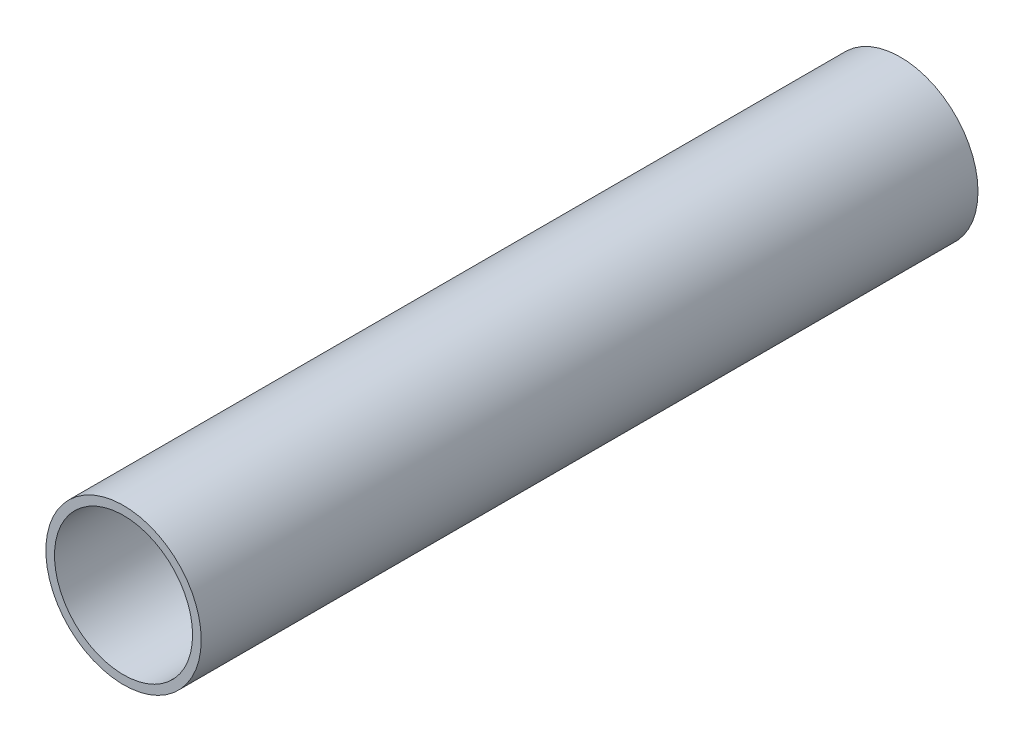
ISO-10303-21;
HEADER;
FILE_DESCRIPTION(('STEP AP214'),'2;1');
FILE_NAME('part.step','',(''),(''),'','','');
FILE_SCHEMA(('AUTOMOTIVE_DESIGN { 1 0 10303 214 1 1 1 1 }'));
ENDSEC;
DATA;
#1=APPLICATION_CONTEXT('core data for automotive mechanical design processes');
#2=APPLICATION_PROTOCOL_DEFINITION('international standard','automotive_design',2000,#1);
#3=PRODUCT_CONTEXT('',#1,'mechanical');
#4=PRODUCT('Part','Part','',(#3));
#5=PRODUCT_RELATED_PRODUCT_CATEGORY('part','',(#4));
#6=PRODUCT_DEFINITION_FORMATION('','',#4);
#7=PRODUCT_DEFINITION_CONTEXT('part definition',#1,'design');
#8=PRODUCT_DEFINITION('design','',#6,#7);
#9=PRODUCT_DEFINITION_SHAPE('','',#8);
#10=(LENGTH_UNIT() NAMED_UNIT(*) SI_UNIT(.MILLI.,.METRE.));
#11=(NAMED_UNIT(*) PLANE_ANGLE_UNIT() SI_UNIT($,.RADIAN.));
#12=(NAMED_UNIT(*) SI_UNIT($,.STERADIAN.) SOLID_ANGLE_UNIT());
#13=UNCERTAINTY_MEASURE_WITH_UNIT(LENGTH_MEASURE(1.E-05),#10,'distance_accuracy_value','');
#14=(GEOMETRIC_REPRESENTATION_CONTEXT(3) GLOBAL_UNCERTAINTY_ASSIGNED_CONTEXT((#13)) GLOBAL_UNIT_ASSIGNED_CONTEXT((#10,
#11,#12)) REPRESENTATION_CONTEXT('',''));
#15=CARTESIAN_POINT('',(0.,0.,0.));
#16=DIRECTION('',(0.,0.,1.));
#17=DIRECTION('',(1.,0.,0.));
#18=AXIS2_PLACEMENT_3D('',#15,#16,#17);
#19=CARTESIAN_POINT('',(0.,0.,180.));
#20=DIRECTION('',(0.,0.,1.));
#21=DIRECTION('',(1.,0.,0.));
#22=AXIS2_PLACEMENT_3D('',#19,#20,#21);
#23=PLANE('',#22);
#24=CARTESIAN_POINT('',(0.,0.,180.));
#25=DIRECTION('',(0.,0.,1.));
#26=DIRECTION('',(1.,0.,0.));
#27=AXIS2_PLACEMENT_3D('',#24,#25,#26);
#28=CIRCLE('',#27,18.);
#29=CARTESIAN_POINT('',(18.,0.,180.));
#30=VERTEX_POINT('',#29);
#31=EDGE_CURVE('E10',#30,#30,#28,.T.);
#32=ORIENTED_EDGE('',*,*,#31,.T.);
#33=EDGE_LOOP('',(#32));
#34=FACE_BOUND('',#33,.T.);
#35=CARTESIAN_POINT('',(0.,0.,180.));
#36=DIRECTION('',(0.,0.,1.));
#37=DIRECTION('',(1.,0.,0.));
#38=AXIS2_PLACEMENT_3D('',#35,#36,#37);
#39=CIRCLE('',#38,16.);
#40=CARTESIAN_POINT('',(16.,0.,180.));
#41=VERTEX_POINT('',#40);
#42=EDGE_CURVE('E42',#41,#41,#39,.T.);
#43=ORIENTED_EDGE('',*,*,#42,.F.);
#44=EDGE_LOOP('',(#43));
#45=FACE_BOUND('',#44,.T.);
#46=ADVANCED_FACE('F31',(#34,#45),#23,.T.);
#47=CARTESIAN_POINT('',(0.,0.,0.));
#48=DIRECTION('',(0.,0.,1.));
#49=DIRECTION('',(1.,0.,0.));
#50=AXIS2_PLACEMENT_3D('',#47,#48,#49);
#51=PLANE('',#50);
#52=CARTESIAN_POINT('',(0.,0.,0.));
#53=DIRECTION('',(0.,0.,1.));
#54=DIRECTION('',(1.,0.,0.));
#55=AXIS2_PLACEMENT_3D('',#52,#53,#54);
#56=CIRCLE('',#55,18.);
#57=CARTESIAN_POINT('',(18.,0.,0.));
#58=VERTEX_POINT('',#57);
#59=EDGE_CURVE('E35',#58,#58,#56,.T.);
#60=ORIENTED_EDGE('',*,*,#59,.F.);
#61=EDGE_LOOP('',(#60));
#62=FACE_BOUND('',#61,.T.);
#63=CARTESIAN_POINT('',(0.,0.,0.));
#64=DIRECTION('',(0.,0.,1.));
#65=DIRECTION('',(1.,0.,0.));
#66=AXIS2_PLACEMENT_3D('',#63,#64,#65);
#67=CIRCLE('',#66,16.);
#68=CARTESIAN_POINT('',(16.,0.,0.));
#69=VERTEX_POINT('',#68);
#70=EDGE_CURVE('E44',#69,#69,#67,.T.);
#71=ORIENTED_EDGE('',*,*,#70,.T.);
#72=EDGE_LOOP('',(#71));
#73=FACE_BOUND('',#72,.T.);
#74=ADVANCED_FACE('F54',(#62,#73),#51,.F.);
#75=CARTESIAN_POINT('',(0.,0.,180.));
#76=DIRECTION('',(0.,0.,-1.));
#77=DIRECTION('',(-1.,0.,0.));
#78=AXIS2_PLACEMENT_3D('',#75,#76,#77);
#79=CYLINDRICAL_SURFACE('',#78,18.);
#80=ORIENTED_EDGE('',*,*,#31,.F.);
#81=EDGE_LOOP('',(#80));
#82=FACE_BOUND('',#81,.T.);
#83=ORIENTED_EDGE('',*,*,#59,.T.);
#84=EDGE_LOOP('',(#83));
#85=FACE_BOUND('',#84,.T.);
#86=ADVANCED_FACE('F33',(#82,#85),#79,.T.);
#87=CARTESIAN_POINT('',(0.,0.,180.));
#88=DIRECTION('',(0.,0.,-1.));
#89=DIRECTION('',(-1.,0.,0.));
#90=AXIS2_PLACEMENT_3D('',#87,#88,#89);
#91=CYLINDRICAL_SURFACE('',#90,16.);
#92=ORIENTED_EDGE('',*,*,#42,.T.);
#93=EDGE_LOOP('',(#92));
#94=FACE_BOUND('',#93,.T.);
#95=ORIENTED_EDGE('',*,*,#70,.F.);
#96=EDGE_LOOP('',(#95));
#97=FACE_BOUND('',#96,.T.);
#98=ADVANCED_FACE('F50',(#94,#97),#91,.F.);
#99=CLOSED_SHELL('',(#46,#74,#86,#98));
#100=MANIFOLD_SOLID_BREP('B2',#99);
#101=ADVANCED_BREP_SHAPE_REPRESENTATION('',(#18,#100),#14);
#102=SHAPE_DEFINITION_REPRESENTATION(#9,#101);
ENDSEC;
END-ISO-10303-21;
